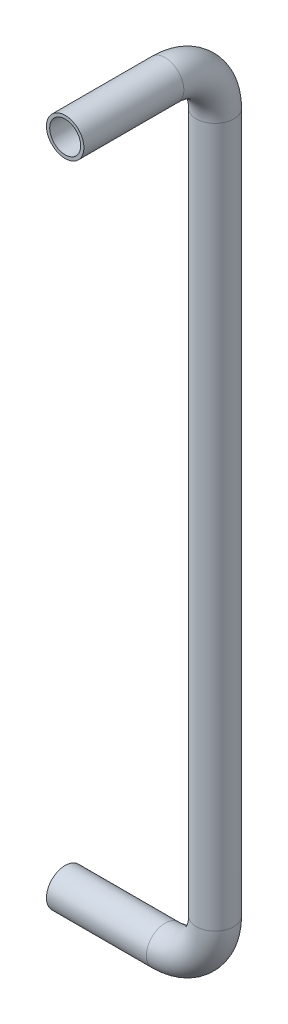
ISO-10303-21;
HEADER;
FILE_DESCRIPTION(('STEP AP214'),'2;1');
FILE_NAME('part.step','',(''),(''),'','','');
FILE_SCHEMA(('AUTOMOTIVE_DESIGN { 1 0 10303 214 1 1 1 1 }'));
ENDSEC;
DATA;
#1=APPLICATION_CONTEXT('core data for automotive mechanical design processes');
#2=APPLICATION_PROTOCOL_DEFINITION('international standard','automotive_design',2000,#1);
#3=PRODUCT_CONTEXT('',#1,'mechanical');
#4=PRODUCT('Part','Part','',(#3));
#5=PRODUCT_RELATED_PRODUCT_CATEGORY('part','',(#4));
#6=PRODUCT_DEFINITION_FORMATION('','',#4);
#7=PRODUCT_DEFINITION_CONTEXT('part definition',#1,'design');
#8=PRODUCT_DEFINITION('design','',#6,#7);
#9=PRODUCT_DEFINITION_SHAPE('','',#8);
#10=(LENGTH_UNIT() NAMED_UNIT(*) SI_UNIT(.MILLI.,.METRE.));
#11=(NAMED_UNIT(*) PLANE_ANGLE_UNIT() SI_UNIT($,.RADIAN.));
#12=(NAMED_UNIT(*) SI_UNIT($,.STERADIAN.) SOLID_ANGLE_UNIT());
#13=UNCERTAINTY_MEASURE_WITH_UNIT(LENGTH_MEASURE(1.E-05),#10,'distance_accuracy_value','');
#14=(GEOMETRIC_REPRESENTATION_CONTEXT(3) GLOBAL_UNCERTAINTY_ASSIGNED_CONTEXT((#13)) GLOBAL_UNIT_ASSIGNED_CONTEXT((#10,
#11,#12)) REPRESENTATION_CONTEXT('',''));
#15=CARTESIAN_POINT('',(0.,0.,0.));
#16=DIRECTION('',(0.,0.,1.));
#17=DIRECTION('',(1.,0.,0.));
#18=AXIS2_PLACEMENT_3D('',#15,#16,#17);
#19=CARTESIAN_POINT('',(0.,0.,0.));
#20=DIRECTION('',(1.,0.,0.));
#21=DIRECTION('',(0.,0.,-1.));
#22=AXIS2_PLACEMENT_3D('',#19,#20,#21);
#23=CYLINDRICAL_SURFACE('',#22,9.525);
#24=CARTESIAN_POINT('',(50.8,0.,0.));
#25=DIRECTION('',(1.,0.,0.));
#26=DIRECTION('',(0.,0.,-1.));
#27=AXIS2_PLACEMENT_3D('',#24,#25,#26);
#28=CIRCLE('',#27,9.525);
#29=CARTESIAN_POINT('',(50.8,-9.52499999999999,0.));
#30=VERTEX_POINT('',#29);
#31=EDGE_CURVE('E55',#30,#30,#28,.T.);
#32=ORIENTED_EDGE('',*,*,#31,.F.);
#33=EDGE_LOOP('',(#32));
#34=FACE_BOUND('',#33,.T.);
#35=CARTESIAN_POINT('',(0.,0.,0.));
#36=DIRECTION('',(1.,0.,0.));
#37=DIRECTION('',(0.,0.,-1.));
#38=AXIS2_PLACEMENT_3D('',#35,#36,#37);
#39=CIRCLE('',#38,9.525);
#40=CARTESIAN_POINT('',(0.,0.,-9.525));
#41=VERTEX_POINT('',#40);
#42=EDGE_CURVE('E53',#41,#41,#39,.T.);
#43=ORIENTED_EDGE('',*,*,#42,.T.);
#44=EDGE_LOOP('',(#43));
#45=FACE_BOUND('',#44,.T.);
#46=ADVANCED_FACE('F32',(#34,#45),#23,.T.);
#47=CARTESIAN_POINT('',(50.8,25.4,0.));
#48=DIRECTION('',(0.,0.,1.));
#49=DIRECTION('',(1.,0.,0.));
#50=AXIS2_PLACEMENT_3D('',#47,#48,#49);
#51=TOROIDAL_SURFACE('',#50,25.4,9.525);
#52=CARTESIAN_POINT('',(76.2,25.4,0.));
#53=DIRECTION('',(0.,1.,0.));
#54=DIRECTION('',(0.,0.,-1.));
#55=AXIS2_PLACEMENT_3D('',#52,#53,#54);
#56=CIRCLE('',#55,9.525);
#57=CARTESIAN_POINT('',(85.725,25.4,0.));
#58=VERTEX_POINT('',#57);
#59=EDGE_CURVE('E36',#58,#58,#56,.T.);
#60=CARTESIAN_POINT('',(50.8,25.4,0.));
#61=DIRECTION('',(0.,0.,1.));
#62=DIRECTION('',(1.,0.,0.));
#63=AXIS2_PLACEMENT_3D('',#60,#61,#62);
#64=CIRCLE('',#63,34.925);
#65=EDGE_CURVE('',#30,#58,#64,.T.);
#66=ORIENTED_EDGE('',*,*,#31,.T.);
#67=ORIENTED_EDGE('',*,*,#59,.F.);
#68=ORIENTED_EDGE('',*,*,#65,.T.);
#69=ORIENTED_EDGE('',*,*,#65,.F.);
#70=EDGE_LOOP('',(#66,#68,#67,#69));
#71=FACE_BOUND('',#70,.T.);
#72=ADVANCED_FACE('F94',(#71),#51,.T.);
#73=CARTESIAN_POINT('',(76.2,25.4,0.));
#74=DIRECTION('',(0.,1.,0.));
#75=DIRECTION('',(-1.,0.,0.));
#76=AXIS2_PLACEMENT_3D('',#73,#74,#75);
#77=CYLINDRICAL_SURFACE('',#76,9.525);
#78=CARTESIAN_POINT('',(76.2,381.,0.));
#79=DIRECTION('',(0.,1.,0.));
#80=DIRECTION('',(0.,0.,-1.));
#81=AXIS2_PLACEMENT_3D('',#78,#79,#80);
#82=CIRCLE('',#81,9.525);
#83=CARTESIAN_POINT('',(76.2,381.,-9.52499999999997));
#84=VERTEX_POINT('',#83);
#85=EDGE_CURVE('E49',#84,#84,#82,.T.);
#86=ORIENTED_EDGE('',*,*,#85,.F.);
#87=EDGE_LOOP('',(#86));
#88=FACE_BOUND('',#87,.T.);
#89=ORIENTED_EDGE('',*,*,#59,.T.);
#90=EDGE_LOOP('',(#89));
#91=FACE_BOUND('',#90,.T.);
#92=ADVANCED_FACE('F34',(#88,#91),#77,.T.);
#93=CARTESIAN_POINT('',(0.,0.,0.));
#94=DIRECTION('',(1.,0.,0.));
#95=DIRECTION('',(0.,0.,-1.));
#96=AXIS2_PLACEMENT_3D('',#93,#94,#95);
#97=PLANE('',#96);
#98=CARTESIAN_POINT('',(0.,0.,0.));
#99=DIRECTION('',(1.,0.,0.));
#100=DIRECTION('',(0.,0.,-1.));
#101=AXIS2_PLACEMENT_3D('',#98,#99,#100);
#102=CIRCLE('',#101,7.874);
#103=CARTESIAN_POINT('',(0.,0.,-7.874));
#104=VERTEX_POINT('',#103);
#105=EDGE_CURVE('E52',#104,#104,#102,.F.);
#106=ORIENTED_EDGE('',*,*,#105,.F.);
#107=EDGE_LOOP('',(#106));
#108=FACE_BOUND('',#107,.T.);
#109=ORIENTED_EDGE('',*,*,#42,.F.);
#110=EDGE_LOOP('',(#109));
#111=FACE_BOUND('',#110,.T.);
#112=ADVANCED_FACE('F84',(#108,#111),#97,.F.);
#113=CARTESIAN_POINT('',(0.,0.,0.));
#114=DIRECTION('',(1.,0.,0.));
#115=DIRECTION('',(0.,0.,-1.));
#116=AXIS2_PLACEMENT_3D('',#113,#114,#115);
#117=CYLINDRICAL_SURFACE('',#116,7.874);
#118=CARTESIAN_POINT('',(50.8,0.,0.));
#119=DIRECTION('',(1.,0.,0.));
#120=DIRECTION('',(0.,0.,-1.));
#121=AXIS2_PLACEMENT_3D('',#118,#119,#120);
#122=CIRCLE('',#121,7.874);
#123=CARTESIAN_POINT('',(50.8,-7.87399999999999,0.));
#124=VERTEX_POINT('',#123);
#125=EDGE_CURVE('E45',#124,#124,#122,.F.);
#126=ORIENTED_EDGE('',*,*,#125,.F.);
#127=EDGE_LOOP('',(#126));
#128=FACE_BOUND('',#127,.T.);
#129=ORIENTED_EDGE('',*,*,#105,.T.);
#130=EDGE_LOOP('',(#129));
#131=FACE_BOUND('',#130,.T.);
#132=ADVANCED_FACE('F81',(#128,#131),#117,.F.);
#133=CARTESIAN_POINT('',(50.8,25.4,0.));
#134=DIRECTION('',(0.,0.,1.));
#135=DIRECTION('',(1.,0.,0.));
#136=AXIS2_PLACEMENT_3D('',#133,#134,#135);
#137=TOROIDAL_SURFACE('',#136,25.4,7.874);
#138=CARTESIAN_POINT('',(76.2,25.4,0.));
#139=DIRECTION('',(0.,1.,0.));
#140=DIRECTION('',(0.,0.,-1.));
#141=AXIS2_PLACEMENT_3D('',#138,#139,#140);
#142=CIRCLE('',#141,7.874);
#143=CARTESIAN_POINT('',(84.074,25.4,0.));
#144=VERTEX_POINT('',#143);
#145=EDGE_CURVE('E40',#144,#144,#142,.F.);
#146=CARTESIAN_POINT('',(50.8,25.4,0.));
#147=DIRECTION('',(0.,0.,1.));
#148=DIRECTION('',(1.,0.,0.));
#149=AXIS2_PLACEMENT_3D('',#146,#147,#148);
#150=CIRCLE('',#149,33.274);
#151=EDGE_CURVE('',#124,#144,#150,.T.);
#152=ORIENTED_EDGE('',*,*,#125,.T.);
#153=ORIENTED_EDGE('',*,*,#145,.F.);
#154=ORIENTED_EDGE('',*,*,#151,.T.);
#155=ORIENTED_EDGE('',*,*,#151,.F.);
#156=EDGE_LOOP('',(#152,#154,#153,#155));
#157=FACE_BOUND('',#156,.T.);
#158=ADVANCED_FACE('F79',(#157),#137,.F.);
#159=CARTESIAN_POINT('',(76.2,25.4,0.));
#160=DIRECTION('',(0.,1.,0.));
#161=DIRECTION('',(-1.,0.,0.));
#162=AXIS2_PLACEMENT_3D('',#159,#160,#161);
#163=CYLINDRICAL_SURFACE('',#162,7.874);
#164=CARTESIAN_POINT('',(76.2,381.,0.));
#165=DIRECTION('',(0.,1.,0.));
#166=DIRECTION('',(0.,0.,-1.));
#167=AXIS2_PLACEMENT_3D('',#164,#165,#166);
#168=CIRCLE('',#167,7.874);
#169=CARTESIAN_POINT('',(76.2,381.,-7.87399999999998));
#170=VERTEX_POINT('',#169);
#171=EDGE_CURVE('E10',#170,#170,#168,.F.);
#172=ORIENTED_EDGE('',*,*,#171,.F.);
#173=EDGE_LOOP('',(#172));
#174=FACE_BOUND('',#173,.T.);
#175=ORIENTED_EDGE('',*,*,#145,.T.);
#176=EDGE_LOOP('',(#175));
#177=FACE_BOUND('',#176,.T.);
#178=ADVANCED_FACE('F105',(#174,#177),#163,.F.);
#179=CARTESIAN_POINT('',(76.2,406.4,76.2));
#180=DIRECTION('',(0.,0.,-1.));
#181=DIRECTION('',(-1.,0.,0.));
#182=AXIS2_PLACEMENT_3D('',#179,#180,#181);
#183=CYLINDRICAL_SURFACE('',#182,9.52499999999999);
#184=CARTESIAN_POINT('',(76.2,406.4,25.4));
#185=DIRECTION('',(0.,0.,1.));
#186=DIRECTION('',(-1.,0.,0.));
#187=AXIS2_PLACEMENT_3D('',#184,#185,#186);
#188=CIRCLE('',#187,9.52499999999999);
#189=CARTESIAN_POINT('',(76.2,415.925,25.4));
#190=VERTEX_POINT('',#189);
#191=EDGE_CURVE('E72',#190,#190,#188,.T.);
#192=ORIENTED_EDGE('',*,*,#191,.T.);
#193=EDGE_LOOP('',(#192));
#194=FACE_BOUND('',#193,.T.);
#195=CARTESIAN_POINT('',(76.2,406.4,76.2));
#196=DIRECTION('',(0.,0.,1.));
#197=DIRECTION('',(-1.,0.,0.));
#198=AXIS2_PLACEMENT_3D('',#195,#196,#197);
#199=CIRCLE('',#198,9.52499999999999);
#200=CARTESIAN_POINT('',(66.675,406.4,76.2));
#201=VERTEX_POINT('',#200);
#202=EDGE_CURVE('E67',#201,#201,#199,.T.);
#203=ORIENTED_EDGE('',*,*,#202,.F.);
#204=EDGE_LOOP('',(#203));
#205=FACE_BOUND('',#204,.T.);
#206=ADVANCED_FACE('F107',(#194,#205),#183,.T.);
#207=CARTESIAN_POINT('',(76.2,381.,25.4));
#208=DIRECTION('',(-1.,0.,0.));
#209=DIRECTION('',(0.,0.,1.));
#210=AXIS2_PLACEMENT_3D('',#207,#208,#209);
#211=TOROIDAL_SURFACE('',#210,25.4,9.52499999999999);
#212=CARTESIAN_POINT('',(76.2,381.,25.4));
#213=DIRECTION('',(-1.,0.,0.));
#214=DIRECTION('',(0.,0.,1.));
#215=AXIS2_PLACEMENT_3D('',#212,#213,#214);
#216=CIRCLE('',#215,34.925);
#217=EDGE_CURVE('',#190,#84,#216,.T.);
#218=ORIENTED_EDGE('',*,*,#191,.F.);
#219=ORIENTED_EDGE('',*,*,#85,.T.);
#220=ORIENTED_EDGE('',*,*,#217,.T.);
#221=ORIENTED_EDGE('',*,*,#217,.F.);
#222=EDGE_LOOP('',(#218,#220,#219,#221));
#223=FACE_BOUND('',#222,.T.);
#224=ADVANCED_FACE('F114',(#223),#211,.T.);
#225=CARTESIAN_POINT('',(76.2,406.4,76.2));
#226=DIRECTION('',(0.,0.,1.));
#227=DIRECTION('',(-1.,0.,0.));
#228=AXIS2_PLACEMENT_3D('',#225,#226,#227);
#229=PLANE('',#228);
#230=CARTESIAN_POINT('',(76.2,406.4,76.2));
#231=DIRECTION('',(0.,0.,1.));
#232=DIRECTION('',(-1.,0.,0.));
#233=AXIS2_PLACEMENT_3D('',#230,#231,#232);
#234=CIRCLE('',#233,7.874);
#235=CARTESIAN_POINT('',(68.326,406.4,76.2));
#236=VERTEX_POINT('',#235);
#237=EDGE_CURVE('E62',#236,#236,#234,.F.);
#238=ORIENTED_EDGE('',*,*,#237,.T.);
#239=EDGE_LOOP('',(#238));
#240=FACE_BOUND('',#239,.T.);
#241=ORIENTED_EDGE('',*,*,#202,.T.);
#242=EDGE_LOOP('',(#241));
#243=FACE_BOUND('',#242,.T.);
#244=ADVANCED_FACE('F122',(#240,#243),#229,.T.);
#245=CARTESIAN_POINT('',(76.2,406.4,76.2));
#246=DIRECTION('',(0.,0.,-1.));
#247=DIRECTION('',(-1.,0.,0.));
#248=AXIS2_PLACEMENT_3D('',#245,#246,#247);
#249=CYLINDRICAL_SURFACE('',#248,7.874);
#250=CARTESIAN_POINT('',(76.2,406.4,25.4));
#251=DIRECTION('',(0.,0.,1.));
#252=DIRECTION('',(-1.,0.,0.));
#253=AXIS2_PLACEMENT_3D('',#250,#251,#252);
#254=CIRCLE('',#253,7.874);
#255=CARTESIAN_POINT('',(76.2,414.274,25.4));
#256=VERTEX_POINT('',#255);
#257=EDGE_CURVE('E57',#256,#256,#254,.F.);
#258=ORIENTED_EDGE('',*,*,#257,.T.);
#259=EDGE_LOOP('',(#258));
#260=FACE_BOUND('',#259,.T.);
#261=ORIENTED_EDGE('',*,*,#237,.F.);
#262=EDGE_LOOP('',(#261));
#263=FACE_BOUND('',#262,.T.);
#264=ADVANCED_FACE('F103',(#260,#263),#249,.F.);
#265=CARTESIAN_POINT('',(76.2,381.,25.4));
#266=DIRECTION('',(-1.,0.,0.));
#267=DIRECTION('',(0.,0.,1.));
#268=AXIS2_PLACEMENT_3D('',#265,#266,#267);
#269=TOROIDAL_SURFACE('',#268,25.4,7.874);
#270=CARTESIAN_POINT('',(76.2,381.,25.4));
#271=DIRECTION('',(-1.,0.,0.));
#272=DIRECTION('',(0.,0.,1.));
#273=AXIS2_PLACEMENT_3D('',#270,#271,#272);
#274=CIRCLE('',#273,33.274);
#275=EDGE_CURVE('',#256,#170,#274,.T.);
#276=ORIENTED_EDGE('',*,*,#257,.F.);
#277=ORIENTED_EDGE('',*,*,#171,.T.);
#278=ORIENTED_EDGE('',*,*,#275,.T.);
#279=ORIENTED_EDGE('',*,*,#275,.F.);
#280=EDGE_LOOP('',(#276,#278,#277,#279));
#281=FACE_BOUND('',#280,.T.);
#282=ADVANCED_FACE('F97',(#281),#269,.F.);
#283=CLOSED_SHELL('',(#46,#72,#92,#112,#132,#158,#178,#206,#224,#244,#264,#282));
#284=MANIFOLD_SOLID_BREP('B2',#283);
#285=ADVANCED_BREP_SHAPE_REPRESENTATION('',(#18,#284),#14);
#286=SHAPE_DEFINITION_REPRESENTATION(#9,#285);
ENDSEC;
END-ISO-10303-21;
